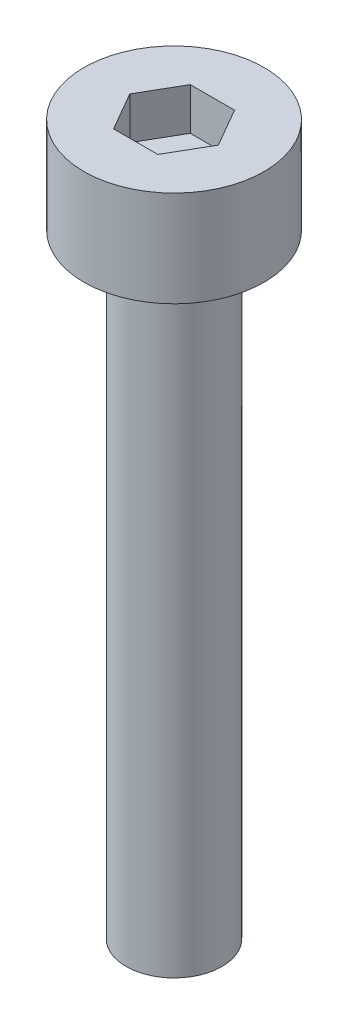
ISO-10303-21;
HEADER;
FILE_DESCRIPTION(('STEP AP214'),'2;1');
FILE_NAME('part.step','',(''),(''),'','','');
FILE_SCHEMA(('AUTOMOTIVE_DESIGN { 1 0 10303 214 1 1 1 1 }'));
ENDSEC;
DATA;
#1=APPLICATION_CONTEXT('core data for automotive mechanical design processes');
#2=APPLICATION_PROTOCOL_DEFINITION('international standard','automotive_design',2000,#1);
#3=PRODUCT_CONTEXT('',#1,'mechanical');
#4=PRODUCT('Part','Part','',(#3));
#5=PRODUCT_RELATED_PRODUCT_CATEGORY('part','',(#4));
#6=PRODUCT_DEFINITION_FORMATION('','',#4);
#7=PRODUCT_DEFINITION_CONTEXT('part definition',#1,'design');
#8=PRODUCT_DEFINITION('design','',#6,#7);
#9=PRODUCT_DEFINITION_SHAPE('','',#8);
#10=(LENGTH_UNIT() NAMED_UNIT(*) SI_UNIT(.MILLI.,.METRE.));
#11=(NAMED_UNIT(*) PLANE_ANGLE_UNIT() SI_UNIT($,.RADIAN.));
#12=(NAMED_UNIT(*) SI_UNIT($,.STERADIAN.) SOLID_ANGLE_UNIT());
#13=UNCERTAINTY_MEASURE_WITH_UNIT(LENGTH_MEASURE(1.E-05),#10,'distance_accuracy_value','');
#14=(GEOMETRIC_REPRESENTATION_CONTEXT(3) GLOBAL_UNCERTAINTY_ASSIGNED_CONTEXT((#13)) GLOBAL_UNIT_ASSIGNED_CONTEXT((#10,
#11,#12)) REPRESENTATION_CONTEXT('',''));
#15=CARTESIAN_POINT('',(0.,0.,0.));
#16=DIRECTION('',(0.,0.,1.));
#17=DIRECTION('',(1.,0.,0.));
#18=AXIS2_PLACEMENT_3D('',#15,#16,#17);
#19=CARTESIAN_POINT('',(0.,2.5,0.));
#20=DIRECTION('',(0.,-1.,0.));
#21=DIRECTION('',(0.,0.,-1.));
#22=AXIS2_PLACEMENT_3D('',#19,#20,#21);
#23=CYLINDRICAL_SURFACE('',#22,2.35);
#24=CARTESIAN_POINT('',(0.,2.5,0.));
#25=DIRECTION('',(0.,1.,0.));
#26=DIRECTION('',(0.,0.,1.));
#27=AXIS2_PLACEMENT_3D('',#24,#25,#26);
#28=CIRCLE('',#27,2.35);
#29=CARTESIAN_POINT('',(0.,2.5,2.35));
#30=VERTEX_POINT('',#29);
#31=EDGE_CURVE('E45',#30,#30,#28,.T.);
#32=ORIENTED_EDGE('',*,*,#31,.F.);
#33=EDGE_LOOP('',(#32));
#34=FACE_BOUND('',#33,.T.);
#35=CARTESIAN_POINT('',(0.,0.,0.));
#36=DIRECTION('',(0.,1.,0.));
#37=DIRECTION('',(0.,0.,1.));
#38=AXIS2_PLACEMENT_3D('',#35,#36,#37);
#39=CIRCLE('',#38,2.35);
#40=CARTESIAN_POINT('',(0.,0.,2.35));
#41=VERTEX_POINT('',#40);
#42=EDGE_CURVE('E40',#41,#41,#39,.T.);
#43=ORIENTED_EDGE('',*,*,#42,.T.);
#44=EDGE_LOOP('',(#43));
#45=FACE_BOUND('',#44,.T.);
#46=ADVANCED_FACE('F37',(#34,#45),#23,.T.);
#47=CARTESIAN_POINT('',(0.,2.5,0.));
#48=DIRECTION('',(0.,1.,0.));
#49=DIRECTION('',(0.,0.,1.));
#50=AXIS2_PLACEMENT_3D('',#47,#48,#49);
#51=PLANE('',#50);
#52=DIRECTION('',(0.5,0.,-0.866025403784439));
#53=VECTOR('',#52,1.);
#54=CARTESIAN_POINT('',(0.577350269189626,2.5,1.));
#55=LINE('',#54,#53);
#56=CARTESIAN_POINT('',(0.577350269189626,2.5,1.));
#57=VERTEX_POINT('',#56);
#58=CARTESIAN_POINT('',(1.15470053837925,2.5,0.));
#59=VERTEX_POINT('',#58);
#60=EDGE_CURVE('E53',#57,#59,#55,.T.);
#61=ORIENTED_EDGE('',*,*,#60,.F.);
#62=DIRECTION('',(1.,0.,0.));
#63=VECTOR('',#62,1.);
#64=CARTESIAN_POINT('',(-0.577350269189627,2.5,1.));
#65=LINE('',#64,#63);
#66=CARTESIAN_POINT('',(-0.577350269189627,2.5,1.));
#67=VERTEX_POINT('',#66);
#68=EDGE_CURVE('E137',#67,#57,#65,.T.);
#69=ORIENTED_EDGE('',*,*,#68,.F.);
#70=DIRECTION('',(0.5,0.,0.866025403784439));
#71=VECTOR('',#70,1.);
#72=CARTESIAN_POINT('',(-1.15470053837925,2.5,0.));
#73=LINE('',#72,#71);
#74=CARTESIAN_POINT('',(-1.15470053837925,2.5,0.));
#75=VERTEX_POINT('',#74);
#76=EDGE_CURVE('E135',#75,#67,#73,.T.);
#77=ORIENTED_EDGE('',*,*,#76,.F.);
#78=DIRECTION('',(-0.5,0.,0.866025403784438));
#79=VECTOR('',#78,1.);
#80=CARTESIAN_POINT('',(-0.577350269189626,2.5,-1.));
#81=LINE('',#80,#79);
#82=CARTESIAN_POINT('',(-0.577350269189626,2.5,-1.));
#83=VERTEX_POINT('',#82);
#84=EDGE_CURVE('E101',#83,#75,#81,.T.);
#85=ORIENTED_EDGE('',*,*,#84,.F.);
#86=DIRECTION('',(-1.,0.,0.));
#87=VECTOR('',#86,1.);
#88=CARTESIAN_POINT('',(0.577350269189626,2.5,-1.));
#89=LINE('',#88,#87);
#90=CARTESIAN_POINT('',(0.577350269189626,2.5,-1.));
#91=VERTEX_POINT('',#90);
#92=EDGE_CURVE('E131',#91,#83,#89,.T.);
#93=ORIENTED_EDGE('',*,*,#92,.F.);
#94=DIRECTION('',(-0.5,0.,-0.866025403784439));
#95=VECTOR('',#94,1.);
#96=CARTESIAN_POINT('',(1.15470053837925,2.5,0.));
#97=LINE('',#96,#95);
#98=EDGE_CURVE('E127',#59,#91,#97,.T.);
#99=ORIENTED_EDGE('',*,*,#98,.F.);
#100=EDGE_LOOP('',(#61,#69,#77,#85,#93,#99));
#101=FACE_BOUND('',#100,.T.);
#102=ORIENTED_EDGE('',*,*,#31,.T.);
#103=EDGE_LOOP('',(#102));
#104=FACE_BOUND('',#103,.T.);
#105=ADVANCED_FACE('F155',(#101,#104),#51,.T.);
#106=CARTESIAN_POINT('',(0.,0.,0.));
#107=DIRECTION('',(0.,1.,0.));
#108=DIRECTION('',(0.,0.,1.));
#109=AXIS2_PLACEMENT_3D('',#106,#107,#108);
#110=PLANE('',#109);
#111=CARTESIAN_POINT('',(0.,0.,0.));
#112=DIRECTION('',(0.,-1.,0.));
#113=DIRECTION('',(0.,0.,-1.));
#114=AXIS2_PLACEMENT_3D('',#111,#112,#113);
#115=CIRCLE('',#114,1.25);
#116=CARTESIAN_POINT('',(0.,0.,-1.25));
#117=VERTEX_POINT('',#116);
#118=EDGE_CURVE('E11',#117,#117,#115,.T.);
#119=ORIENTED_EDGE('',*,*,#118,.F.);
#120=EDGE_LOOP('',(#119));
#121=FACE_BOUND('',#120,.T.);
#122=ORIENTED_EDGE('',*,*,#42,.F.);
#123=EDGE_LOOP('',(#122));
#124=FACE_BOUND('',#123,.T.);
#125=ADVANCED_FACE('F152',(#121,#124),#110,.F.);
#126=CARTESIAN_POINT('',(0.577350269189626,1.4,1.));
#127=DIRECTION('',(0.866025403784439,0.,0.5));
#128=DIRECTION('',(0.5,0.,-0.866025403784439));
#129=AXIS2_PLACEMENT_3D('',#126,#127,#128);
#130=PLANE('',#129);
#131=ORIENTED_EDGE('',*,*,#60,.T.);
#132=DIRECTION('',(0.,1.,0.));
#133=VECTOR('',#132,1.);
#134=CARTESIAN_POINT('',(1.15470053837925,1.4,0.));
#135=LINE('',#134,#133);
#136=CARTESIAN_POINT('',(1.15470053837925,1.4,0.));
#137=VERTEX_POINT('',#136);
#138=EDGE_CURVE('E83',#137,#59,#135,.T.);
#139=ORIENTED_EDGE('',*,*,#138,.F.);
#140=DIRECTION('',(0.5,0.,-0.866025403784439));
#141=VECTOR('',#140,1.);
#142=CARTESIAN_POINT('',(0.577350269189626,1.4,1.));
#143=LINE('',#142,#141);
#144=CARTESIAN_POINT('',(0.577350269189626,1.4,1.));
#145=VERTEX_POINT('',#144);
#146=EDGE_CURVE('E139',#145,#137,#143,.T.);
#147=ORIENTED_EDGE('',*,*,#146,.F.);
#148=DIRECTION('',(0.,1.,0.));
#149=VECTOR('',#148,1.);
#150=CARTESIAN_POINT('',(0.577350269189626,1.4,1.));
#151=LINE('',#150,#149);
#152=EDGE_CURVE('E61',#145,#57,#151,.T.);
#153=ORIENTED_EDGE('',*,*,#152,.T.);
#154=EDGE_LOOP('',(#131,#139,#147,#153));
#155=FACE_BOUND('',#154,.T.);
#156=ADVANCED_FACE('F154',(#155),#130,.F.);
#157=CARTESIAN_POINT('',(-0.577350269189627,1.4,1.));
#158=DIRECTION('',(0.,0.,1.));
#159=DIRECTION('',(1.,0.,0.));
#160=AXIS2_PLACEMENT_3D('',#157,#158,#159);
#161=PLANE('',#160);
#162=ORIENTED_EDGE('',*,*,#68,.T.);
#163=ORIENTED_EDGE('',*,*,#152,.F.);
#164=DIRECTION('',(1.,0.,0.));
#165=VECTOR('',#164,1.);
#166=CARTESIAN_POINT('',(-0.577350269189627,1.4,1.));
#167=LINE('',#166,#165);
#168=CARTESIAN_POINT('',(-0.577350269189627,1.4,1.));
#169=VERTEX_POINT('',#168);
#170=EDGE_CURVE('E113',#169,#145,#167,.T.);
#171=ORIENTED_EDGE('',*,*,#170,.F.);
#172=DIRECTION('',(0.,1.,0.));
#173=VECTOR('',#172,1.);
#174=CARTESIAN_POINT('',(-0.577350269189627,1.4,1.));
#175=LINE('',#174,#173);
#176=EDGE_CURVE('E105',#169,#67,#175,.T.);
#177=ORIENTED_EDGE('',*,*,#176,.T.);
#178=EDGE_LOOP('',(#162,#163,#171,#177));
#179=FACE_BOUND('',#178,.T.);
#180=ADVANCED_FACE('F161',(#179),#161,.F.);
#181=CARTESIAN_POINT('',(-1.15470053837925,1.4,0.));
#182=DIRECTION('',(-0.866025403784439,0.,0.5));
#183=DIRECTION('',(0.5,0.,0.866025403784439));
#184=AXIS2_PLACEMENT_3D('',#181,#182,#183);
#185=PLANE('',#184);
#186=ORIENTED_EDGE('',*,*,#76,.T.);
#187=ORIENTED_EDGE('',*,*,#176,.F.);
#188=DIRECTION('',(0.5,0.,0.866025403784439));
#189=VECTOR('',#188,1.);
#190=CARTESIAN_POINT('',(-1.15470053837925,1.4,0.));
#191=LINE('',#190,#189);
#192=CARTESIAN_POINT('',(-1.15470053837925,1.4,0.));
#193=VERTEX_POINT('',#192);
#194=EDGE_CURVE('E109',#193,#169,#191,.T.);
#195=ORIENTED_EDGE('',*,*,#194,.F.);
#196=DIRECTION('',(0.,1.,0.));
#197=VECTOR('',#196,1.);
#198=CARTESIAN_POINT('',(-1.15470053837925,1.4,0.));
#199=LINE('',#198,#197);
#200=EDGE_CURVE('E94',#193,#75,#199,.T.);
#201=ORIENTED_EDGE('',*,*,#200,.T.);
#202=EDGE_LOOP('',(#186,#187,#195,#201));
#203=FACE_BOUND('',#202,.T.);
#204=ADVANCED_FACE('F110',(#203),#185,.F.);
#205=CARTESIAN_POINT('',(-0.577350269189626,1.4,-1.));
#206=DIRECTION('',(-0.866025403784439,0.,-0.5));
#207=DIRECTION('',(-0.5,0.,0.866025403784438));
#208=AXIS2_PLACEMENT_3D('',#205,#206,#207);
#209=PLANE('',#208);
#210=ORIENTED_EDGE('',*,*,#84,.T.);
#211=ORIENTED_EDGE('',*,*,#200,.F.);
#212=DIRECTION('',(-0.5,0.,0.866025403784438));
#213=VECTOR('',#212,1.);
#214=CARTESIAN_POINT('',(-0.577350269189626,1.4,-1.));
#215=LINE('',#214,#213);
#216=CARTESIAN_POINT('',(-0.577350269189626,1.4,-1.));
#217=VERTEX_POINT('',#216);
#218=EDGE_CURVE('E98',#217,#193,#215,.T.);
#219=ORIENTED_EDGE('',*,*,#218,.F.);
#220=DIRECTION('',(0.,1.,0.));
#221=VECTOR('',#220,1.);
#222=CARTESIAN_POINT('',(-0.577350269189626,1.4,-1.));
#223=LINE('',#222,#221);
#224=EDGE_CURVE('E106',#217,#83,#223,.T.);
#225=ORIENTED_EDGE('',*,*,#224,.T.);
#226=EDGE_LOOP('',(#210,#211,#219,#225));
#227=FACE_BOUND('',#226,.T.);
#228=ADVANCED_FACE('F96',(#227),#209,.F.);
#229=CARTESIAN_POINT('',(0.577350269189626,1.4,-1.));
#230=DIRECTION('',(0.,0.,-1.));
#231=DIRECTION('',(-1.,0.,0.));
#232=AXIS2_PLACEMENT_3D('',#229,#230,#231);
#233=PLANE('',#232);
#234=ORIENTED_EDGE('',*,*,#92,.T.);
#235=ORIENTED_EDGE('',*,*,#224,.F.);
#236=DIRECTION('',(-1.,0.,0.));
#237=VECTOR('',#236,1.);
#238=CARTESIAN_POINT('',(0.577350269189626,1.4,-1.));
#239=LINE('',#238,#237);
#240=CARTESIAN_POINT('',(0.577350269189626,1.4,-1.));
#241=VERTEX_POINT('',#240);
#242=EDGE_CURVE('E119',#241,#217,#239,.T.);
#243=ORIENTED_EDGE('',*,*,#242,.F.);
#244=DIRECTION('',(0.,1.,0.));
#245=VECTOR('',#244,1.);
#246=CARTESIAN_POINT('',(0.577350269189626,1.4,-1.));
#247=LINE('',#246,#245);
#248=EDGE_CURVE('E143',#241,#91,#247,.T.);
#249=ORIENTED_EDGE('',*,*,#248,.T.);
#250=EDGE_LOOP('',(#234,#235,#243,#249));
#251=FACE_BOUND('',#250,.T.);
#252=ADVANCED_FACE('F206',(#251),#233,.F.);
#253=CARTESIAN_POINT('',(1.15470053837925,1.4,0.));
#254=DIRECTION('',(0.866025403784439,0.,-0.5));
#255=DIRECTION('',(-0.5,0.,-0.866025403784439));
#256=AXIS2_PLACEMENT_3D('',#253,#254,#255);
#257=PLANE('',#256);
#258=ORIENTED_EDGE('',*,*,#98,.T.);
#259=ORIENTED_EDGE('',*,*,#248,.F.);
#260=DIRECTION('',(-0.5,0.,-0.866025403784439));
#261=VECTOR('',#260,1.);
#262=CARTESIAN_POINT('',(1.15470053837925,1.4,0.));
#263=LINE('',#262,#261);
#264=EDGE_CURVE('E121',#137,#241,#263,.T.);
#265=ORIENTED_EDGE('',*,*,#264,.F.);
#266=ORIENTED_EDGE('',*,*,#138,.T.);
#267=EDGE_LOOP('',(#258,#259,#265,#266));
#268=FACE_BOUND('',#267,.T.);
#269=ADVANCED_FACE('F215',(#268),#257,.F.);
#270=CARTESIAN_POINT('',(0.,1.4,0.));
#271=DIRECTION('',(0.,1.,0.));
#272=DIRECTION('',(0.,0.,1.));
#273=AXIS2_PLACEMENT_3D('',#270,#271,#272);
#274=PLANE('',#273);
#275=ORIENTED_EDGE('',*,*,#146,.T.);
#276=ORIENTED_EDGE('',*,*,#264,.T.);
#277=ORIENTED_EDGE('',*,*,#242,.T.);
#278=ORIENTED_EDGE('',*,*,#218,.T.);
#279=ORIENTED_EDGE('',*,*,#194,.T.);
#280=ORIENTED_EDGE('',*,*,#170,.T.);
#281=EDGE_LOOP('',(#275,#276,#277,#278,#279,#280));
#282=FACE_BOUND('',#281,.T.);
#283=ADVANCED_FACE('F116',(#282),#274,.T.);
#284=CARTESIAN_POINT('',(0.,-16.,0.));
#285=DIRECTION('',(0.,1.,0.));
#286=DIRECTION('',(0.,0.,1.));
#287=AXIS2_PLACEMENT_3D('',#284,#285,#286);
#288=CYLINDRICAL_SURFACE('',#287,1.25);
#289=CARTESIAN_POINT('',(0.,-16.,0.));
#290=DIRECTION('',(0.,-1.,0.));
#291=DIRECTION('',(0.,0.,-1.));
#292=AXIS2_PLACEMENT_3D('',#289,#290,#291);
#293=CIRCLE('',#292,1.25);
#294=CARTESIAN_POINT('',(0.,-16.,-1.25));
#295=VERTEX_POINT('',#294);
#296=EDGE_CURVE('E128',#295,#295,#293,.T.);
#297=ORIENTED_EDGE('',*,*,#296,.F.);
#298=EDGE_LOOP('',(#297));
#299=FACE_BOUND('',#298,.T.);
#300=ORIENTED_EDGE('',*,*,#118,.T.);
#301=EDGE_LOOP('',(#300));
#302=FACE_BOUND('',#301,.T.);
#303=ADVANCED_FACE('F233',(#299,#302),#288,.T.);
#304=CARTESIAN_POINT('',(0.,-16.,0.));
#305=DIRECTION('',(0.,-1.,0.));
#306=DIRECTION('',(0.,0.,-1.));
#307=AXIS2_PLACEMENT_3D('',#304,#305,#306);
#308=PLANE('',#307);
#309=ORIENTED_EDGE('',*,*,#296,.T.);
#310=EDGE_LOOP('',(#309));
#311=FACE_BOUND('',#310,.T.);
#312=ADVANCED_FACE('F247',(#311),#308,.T.);
#313=CLOSED_SHELL('',(#46,#105,#125,#156,#180,#204,#228,#252,#269,#283,#303,#312));
#314=MANIFOLD_SOLID_BREP('B2',#313);
#315=ADVANCED_BREP_SHAPE_REPRESENTATION('',(#18,#314),#14);
#316=SHAPE_DEFINITION_REPRESENTATION(#9,#315);
ENDSEC;
END-ISO-10303-21;
